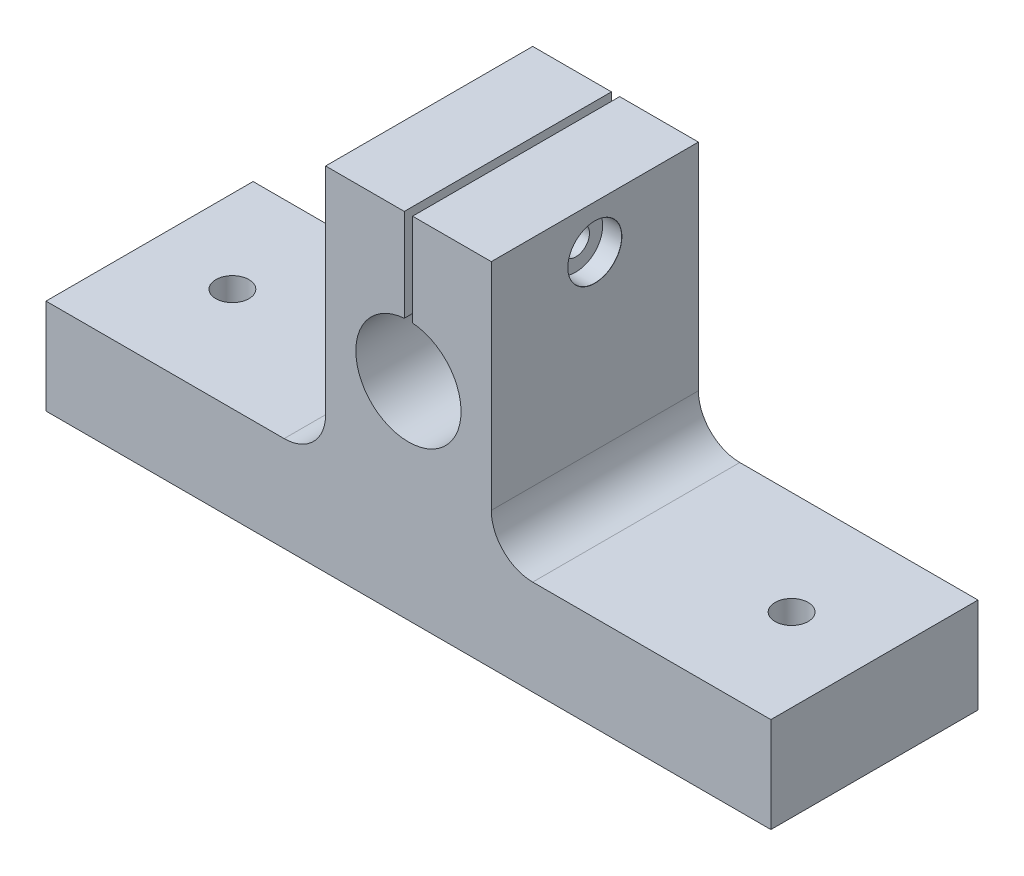
ISO-10303-21;
HEADER;
FILE_DESCRIPTION(('STEP AP214'),'2;1');
FILE_NAME('part.step','',(''),(''),'','','');
FILE_SCHEMA(('AUTOMOTIVE_DESIGN { 1 0 10303 214 1 1 1 1 }'));
ENDSEC;
DATA;
#1=APPLICATION_CONTEXT('core data for automotive mechanical design processes');
#2=APPLICATION_PROTOCOL_DEFINITION('international standard','automotive_design',2000,#1);
#3=PRODUCT_CONTEXT('',#1,'mechanical');
#4=PRODUCT('Part','Part','',(#3));
#5=PRODUCT_RELATED_PRODUCT_CATEGORY('part','',(#4));
#6=PRODUCT_DEFINITION_FORMATION('','',#4);
#7=PRODUCT_DEFINITION_CONTEXT('part definition',#1,'design');
#8=PRODUCT_DEFINITION('design','',#6,#7);
#9=PRODUCT_DEFINITION_SHAPE('','',#8);
#10=(LENGTH_UNIT() NAMED_UNIT(*) SI_UNIT(.MILLI.,.METRE.));
#11=(NAMED_UNIT(*) PLANE_ANGLE_UNIT() SI_UNIT($,.RADIAN.));
#12=(NAMED_UNIT(*) SI_UNIT($,.STERADIAN.) SOLID_ANGLE_UNIT());
#13=UNCERTAINTY_MEASURE_WITH_UNIT(LENGTH_MEASURE(1.E-05),#10,'distance_accuracy_value','');
#14=(GEOMETRIC_REPRESENTATION_CONTEXT(3) GLOBAL_UNCERTAINTY_ASSIGNED_CONTEXT((#13)) GLOBAL_UNIT_ASSIGNED_CONTEXT((#10,
#11,#12)) REPRESENTATION_CONTEXT('',''));
#15=CARTESIAN_POINT('',(0.,0.,0.));
#16=DIRECTION('',(0.,0.,1.));
#17=DIRECTION('',(1.,0.,0.));
#18=AXIS2_PLACEMENT_3D('',#15,#16,#17);
#19=CARTESIAN_POINT('',(-20.,85.,50.));
#20=DIRECTION('',(0.,-1.,0.));
#21=DIRECTION('',(0.,0.,-1.));
#22=AXIS2_PLACEMENT_3D('',#19,#20,#21);
#23=PLANE('',#22);
#24=DIRECTION('',(0.,0.,1.));
#25=VECTOR('',#24,1.);
#26=CARTESIAN_POINT('',(-1.,85.,0.));
#27=LINE('',#26,#25);
#28=CARTESIAN_POINT('',(-1.,85.,0.));
#29=VERTEX_POINT('',#28);
#30=CARTESIAN_POINT('',(-1.,85.,50.));
#31=VERTEX_POINT('',#30);
#32=EDGE_CURVE('E183',#29,#31,#27,.T.);
#33=ORIENTED_EDGE('',*,*,#32,.F.);
#34=DIRECTION('',(-1.,0.,0.));
#35=VECTOR('',#34,1.);
#36=CARTESIAN_POINT('',(-20.,85.,0.));
#37=LINE('',#36,#35);
#38=CARTESIAN_POINT('',(-20.,85.,0.));
#39=VERTEX_POINT('',#38);
#40=EDGE_CURVE('E166',#29,#39,#37,.T.);
#41=ORIENTED_EDGE('',*,*,#40,.T.);
#42=DIRECTION('',(0.,0.,-1.));
#43=VECTOR('',#42,1.);
#44=CARTESIAN_POINT('',(-20.,85.,50.));
#45=LINE('',#44,#43);
#46=CARTESIAN_POINT('',(-20.,85.,50.));
#47=VERTEX_POINT('',#46);
#48=EDGE_CURVE('E267',#47,#39,#45,.T.);
#49=ORIENTED_EDGE('',*,*,#48,.F.);
#50=DIRECTION('',(-1.,0.,0.));
#51=VECTOR('',#50,1.);
#52=CARTESIAN_POINT('',(-20.,85.,50.));
#53=LINE('',#52,#51);
#54=EDGE_CURVE('E226',#31,#47,#53,.T.);
#55=ORIENTED_EDGE('',*,*,#54,.F.);
#56=EDGE_LOOP('',(#33,#41,#49,#55));
#57=FACE_BOUND('',#56,.T.);
#58=ADVANCED_FACE('F39',(#57),#23,.F.);
#59=CARTESIAN_POINT('',(0.,0.,50.));
#60=DIRECTION('',(0.,0.,-1.));
#61=DIRECTION('',(-1.,0.,0.));
#62=AXIS2_PLACEMENT_3D('',#59,#60,#61);
#63=PLANE('',#62);
#64=DIRECTION('',(0.,1.,0.));
#65=VECTOR('',#64,1.);
#66=CARTESIAN_POINT('',(-1.,0.,50.));
#67=LINE('',#66,#65);
#68=CARTESIAN_POINT('',(-1.,62.6605687076055,50.));
#69=VERTEX_POINT('',#68);
#70=EDGE_CURVE('E148',#69,#31,#67,.T.);
#71=ORIENTED_EDGE('',*,*,#70,.T.);
#72=ORIENTED_EDGE('',*,*,#54,.T.);
#73=DIRECTION('',(0.,-1.,0.));
#74=VECTOR('',#73,1.);
#75=CARTESIAN_POINT('',(-20.,23.,50.));
#76=LINE('',#75,#74);
#77=CARTESIAN_POINT('',(-20.,33.,50.));
#78=VERTEX_POINT('',#77);
#79=EDGE_CURVE('E231',#47,#78,#76,.T.);
#80=ORIENTED_EDGE('',*,*,#79,.T.);
#81=CARTESIAN_POINT('',(-30.,33.,50.));
#82=DIRECTION('',(0.,0.,-1.));
#83=DIRECTION('',(-1.,0.,0.));
#84=AXIS2_PLACEMENT_3D('',#81,#82,#83);
#85=CIRCLE('',#84,10.);
#86=CARTESIAN_POINT('',(-30.,23.,50.));
#87=VERTEX_POINT('',#86);
#88=EDGE_CURVE('E303',#78,#87,#85,.T.);
#89=ORIENTED_EDGE('',*,*,#88,.T.);
#90=DIRECTION('',(-1.,0.,0.));
#91=VECTOR('',#90,1.);
#92=CARTESIAN_POINT('',(-87.5,23.,50.));
#93=LINE('',#92,#91);
#94=CARTESIAN_POINT('',(-87.5,23.,50.));
#95=VERTEX_POINT('',#94);
#96=EDGE_CURVE('E235',#87,#95,#93,.T.);
#97=ORIENTED_EDGE('',*,*,#96,.T.);
#98=DIRECTION('',(0.,-1.,0.));
#99=VECTOR('',#98,1.);
#100=CARTESIAN_POINT('',(-87.5,0.,50.));
#101=LINE('',#100,#99);
#102=CARTESIAN_POINT('',(-87.5,0.,50.));
#103=VERTEX_POINT('',#102);
#104=EDGE_CURVE('E209',#95,#103,#101,.T.);
#105=ORIENTED_EDGE('',*,*,#104,.T.);
#106=DIRECTION('',(1.,0.,0.));
#107=VECTOR('',#106,1.);
#108=CARTESIAN_POINT('',(87.5,0.,50.));
#109=LINE('',#108,#107);
#110=CARTESIAN_POINT('',(87.5,0.,50.));
#111=VERTEX_POINT('',#110);
#112=EDGE_CURVE('E213',#103,#111,#109,.T.);
#113=ORIENTED_EDGE('',*,*,#112,.T.);
#114=DIRECTION('',(0.,1.,0.));
#115=VECTOR('',#114,1.);
#116=CARTESIAN_POINT('',(87.5,0.,50.));
#117=LINE('',#116,#115);
#118=CARTESIAN_POINT('',(87.5,23.,50.));
#119=VERTEX_POINT('',#118);
#120=EDGE_CURVE('E217',#111,#119,#117,.T.);
#121=ORIENTED_EDGE('',*,*,#120,.T.);
#122=DIRECTION('',(-1.,0.,0.));
#123=VECTOR('',#122,1.);
#124=CARTESIAN_POINT('',(87.5,23.,50.));
#125=LINE('',#124,#123);
#126=CARTESIAN_POINT('',(30.,23.,50.));
#127=VERTEX_POINT('',#126);
#128=EDGE_CURVE('E220',#119,#127,#125,.T.);
#129=ORIENTED_EDGE('',*,*,#128,.T.);
#130=CARTESIAN_POINT('',(30.,33.,50.));
#131=DIRECTION('',(0.,0.,-1.));
#132=DIRECTION('',(-1.,0.,0.));
#133=AXIS2_PLACEMENT_3D('',#130,#131,#132);
#134=CIRCLE('',#133,10.);
#135=CARTESIAN_POINT('',(20.,33.,50.));
#136=VERTEX_POINT('',#135);
#137=EDGE_CURVE('E11',#127,#136,#134,.T.);
#138=ORIENTED_EDGE('',*,*,#137,.T.);
#139=DIRECTION('',(0.,1.,0.));
#140=VECTOR('',#139,1.);
#141=CARTESIAN_POINT('',(20.,23.,50.));
#142=LINE('',#141,#140);
#143=CARTESIAN_POINT('',(20.,85.,50.));
#144=VERTEX_POINT('',#143);
#145=EDGE_CURVE('E223',#136,#144,#142,.T.);
#146=ORIENTED_EDGE('',*,*,#145,.T.);
#147=CARTESIAN_POINT('',(1.,85.,50.));
#148=VERTEX_POINT('',#147);
#149=EDGE_CURVE('E227',#144,#148,#53,.T.);
#150=ORIENTED_EDGE('',*,*,#149,.T.);
#151=DIRECTION('',(0.,1.,0.));
#152=VECTOR('',#151,1.);
#153=CARTESIAN_POINT('',(1.,0.,50.));
#154=LINE('',#153,#152);
#155=CARTESIAN_POINT('',(1.,62.6605687076055,50.));
#156=VERTEX_POINT('',#155);
#157=EDGE_CURVE('E168',#156,#148,#154,.T.);
#158=ORIENTED_EDGE('',*,*,#157,.F.);
#159=CARTESIAN_POINT('',(0.,50.,50.));
#160=DIRECTION('',(0.,0.,1.));
#161=DIRECTION('',(1.,0.,0.));
#162=AXIS2_PLACEMENT_3D('',#159,#160,#161);
#163=CIRCLE('',#162,12.7);
#164=EDGE_CURVE('E171',#69,#156,#163,.T.);
#165=ORIENTED_EDGE('',*,*,#164,.F.);
#166=EDGE_LOOP('',(#71,#72,#80,#89,#97,#105,#113,#121,#129,#138,#146,#150,#158,#165));
#167=FACE_BOUND('',#166,.T.);
#168=ADVANCED_FACE('F328',(#167),#63,.F.);
#169=CARTESIAN_POINT('',(0.,0.,0.));
#170=DIRECTION('',(0.,0.,-1.));
#171=DIRECTION('',(-1.,0.,0.));
#172=AXIS2_PLACEMENT_3D('',#169,#170,#171);
#173=PLANE('',#172);
#174=ORIENTED_EDGE('',*,*,#40,.F.);
#175=DIRECTION('',(0.,1.,0.));
#176=VECTOR('',#175,1.);
#177=CARTESIAN_POINT('',(-1.,0.,0.));
#178=LINE('',#177,#176);
#179=CARTESIAN_POINT('',(-1.,62.6605687076055,0.));
#180=VERTEX_POINT('',#179);
#181=EDGE_CURVE('E145',#180,#29,#178,.T.);
#182=ORIENTED_EDGE('',*,*,#181,.F.);
#183=CARTESIAN_POINT('',(0.,50.,0.));
#184=DIRECTION('',(0.,0.,1.));
#185=DIRECTION('',(1.,0.,0.));
#186=AXIS2_PLACEMENT_3D('',#183,#184,#185);
#187=CIRCLE('',#186,12.7);
#188=CARTESIAN_POINT('',(1.,62.6605687076055,0.));
#189=VERTEX_POINT('',#188);
#190=EDGE_CURVE('E158',#180,#189,#187,.T.);
#191=ORIENTED_EDGE('',*,*,#190,.T.);
#192=DIRECTION('',(0.,1.,0.));
#193=VECTOR('',#192,1.);
#194=CARTESIAN_POINT('',(1.,0.,0.));
#195=LINE('',#194,#193);
#196=CARTESIAN_POINT('',(1.,85.,0.));
#197=VERTEX_POINT('',#196);
#198=EDGE_CURVE('E154',#189,#197,#195,.T.);
#199=ORIENTED_EDGE('',*,*,#198,.T.);
#200=CARTESIAN_POINT('',(20.,85.,0.));
#201=VERTEX_POINT('',#200);
#202=EDGE_CURVE('E254',#201,#197,#37,.T.);
#203=ORIENTED_EDGE('',*,*,#202,.F.);
#204=DIRECTION('',(0.,1.,0.));
#205=VECTOR('',#204,1.);
#206=CARTESIAN_POINT('',(20.,23.,0.));
#207=LINE('',#206,#205);
#208=CARTESIAN_POINT('',(20.,33.,0.));
#209=VERTEX_POINT('',#208);
#210=EDGE_CURVE('E251',#209,#201,#207,.T.);
#211=ORIENTED_EDGE('',*,*,#210,.F.);
#212=CARTESIAN_POINT('',(30.,33.,0.));
#213=DIRECTION('',(0.,0.,-1.));
#214=DIRECTION('',(-1.,0.,0.));
#215=AXIS2_PLACEMENT_3D('',#212,#213,#214);
#216=CIRCLE('',#215,10.);
#217=CARTESIAN_POINT('',(30.,23.,0.));
#218=VERTEX_POINT('',#217);
#219=EDGE_CURVE('E49',#209,#218,#216,.F.);
#220=ORIENTED_EDGE('',*,*,#219,.T.);
#221=DIRECTION('',(-1.,0.,0.));
#222=VECTOR('',#221,1.);
#223=CARTESIAN_POINT('',(87.5,23.,0.));
#224=LINE('',#223,#222);
#225=CARTESIAN_POINT('',(87.5,23.,0.));
#226=VERTEX_POINT('',#225);
#227=EDGE_CURVE('E248',#226,#218,#224,.T.);
#228=ORIENTED_EDGE('',*,*,#227,.F.);
#229=DIRECTION('',(0.,1.,0.));
#230=VECTOR('',#229,1.);
#231=CARTESIAN_POINT('',(87.5,0.,0.));
#232=LINE('',#231,#230);
#233=CARTESIAN_POINT('',(87.5,0.,0.));
#234=VERTEX_POINT('',#233);
#235=EDGE_CURVE('E245',#234,#226,#232,.T.);
#236=ORIENTED_EDGE('',*,*,#235,.F.);
#237=DIRECTION('',(1.,0.,0.));
#238=VECTOR('',#237,1.);
#239=CARTESIAN_POINT('',(87.5,0.,0.));
#240=LINE('',#239,#238);
#241=CARTESIAN_POINT('',(-87.5,0.,0.));
#242=VERTEX_POINT('',#241);
#243=EDGE_CURVE('E242',#242,#234,#240,.T.);
#244=ORIENTED_EDGE('',*,*,#243,.F.);
#245=DIRECTION('',(0.,-1.,0.));
#246=VECTOR('',#245,1.);
#247=CARTESIAN_POINT('',(-87.5,0.,0.));
#248=LINE('',#247,#246);
#249=CARTESIAN_POINT('',(-87.5,23.,0.));
#250=VERTEX_POINT('',#249);
#251=EDGE_CURVE('E197',#250,#242,#248,.T.);
#252=ORIENTED_EDGE('',*,*,#251,.F.);
#253=DIRECTION('',(-1.,0.,0.));
#254=VECTOR('',#253,1.);
#255=CARTESIAN_POINT('',(-87.5,23.,0.));
#256=LINE('',#255,#254);
#257=CARTESIAN_POINT('',(-30.,23.,0.));
#258=VERTEX_POINT('',#257);
#259=EDGE_CURVE('E214',#258,#250,#256,.T.);
#260=ORIENTED_EDGE('',*,*,#259,.F.);
#261=CARTESIAN_POINT('',(-30.,33.,0.));
#262=DIRECTION('',(0.,0.,-1.));
#263=DIRECTION('',(-1.,0.,0.));
#264=AXIS2_PLACEMENT_3D('',#261,#262,#263);
#265=CIRCLE('',#264,10.);
#266=CARTESIAN_POINT('',(-20.,33.,0.));
#267=VERTEX_POINT('',#266);
#268=EDGE_CURVE('E300',#258,#267,#265,.F.);
#269=ORIENTED_EDGE('',*,*,#268,.T.);
#270=DIRECTION('',(0.,-1.,0.));
#271=VECTOR('',#270,1.);
#272=CARTESIAN_POINT('',(-20.,23.,0.));
#273=LINE('',#272,#271);
#274=EDGE_CURVE('E258',#39,#267,#273,.T.);
#275=ORIENTED_EDGE('',*,*,#274,.F.);
#276=EDGE_LOOP('',(#174,#182,#191,#199,#203,#211,#220,#228,#236,#244,#252,#260,#269,#275));
#277=FACE_BOUND('',#276,.T.);
#278=ADVANCED_FACE('F164',(#277),#173,.T.);
#279=CARTESIAN_POINT('',(-87.5,0.,50.));
#280=DIRECTION('',(1.,0.,0.));
#281=DIRECTION('',(0.,0.,-1.));
#282=AXIS2_PLACEMENT_3D('',#279,#280,#281);
#283=PLANE('',#282);
#284=ORIENTED_EDGE('',*,*,#251,.T.);
#285=DIRECTION('',(0.,0.,-1.));
#286=VECTOR('',#285,1.);
#287=CARTESIAN_POINT('',(-87.5,0.,50.));
#288=LINE('',#287,#286);
#289=EDGE_CURVE('E283',#103,#242,#288,.T.);
#290=ORIENTED_EDGE('',*,*,#289,.F.);
#291=ORIENTED_EDGE('',*,*,#104,.F.);
#292=DIRECTION('',(0.,0.,-1.));
#293=VECTOR('',#292,1.);
#294=CARTESIAN_POINT('',(-87.5,23.,50.));
#295=LINE('',#294,#293);
#296=EDGE_CURVE('E238',#95,#250,#295,.T.);
#297=ORIENTED_EDGE('',*,*,#296,.T.);
#298=EDGE_LOOP('',(#284,#290,#291,#297));
#299=FACE_BOUND('',#298,.T.);
#300=ADVANCED_FACE('F354',(#299),#283,.F.);
#301=CARTESIAN_POINT('',(87.5,0.,50.));
#302=DIRECTION('',(0.,1.,0.));
#303=DIRECTION('',(0.,0.,1.));
#304=AXIS2_PLACEMENT_3D('',#301,#302,#303);
#305=PLANE('',#304);
#306=CARTESIAN_POINT('',(-67.5,0.,25.));
#307=DIRECTION('',(0.,1.,0.));
#308=DIRECTION('',(0.,0.,1.));
#309=AXIS2_PLACEMENT_3D('',#306,#307,#308);
#310=CIRCLE('',#309,4.00000000000001);
#311=CARTESIAN_POINT('',(-67.5,0.,29.));
#312=VERTEX_POINT('',#311);
#313=EDGE_CURVE('E193',#312,#312,#310,.T.);
#314=ORIENTED_EDGE('',*,*,#313,.T.);
#315=EDGE_LOOP('',(#314));
#316=FACE_BOUND('',#315,.T.);
#317=CARTESIAN_POINT('',(67.5,0.,25.));
#318=DIRECTION('',(0.,1.,0.));
#319=DIRECTION('',(0.,0.,-1.));
#320=AXIS2_PLACEMENT_3D('',#317,#318,#319);
#321=CIRCLE('',#320,4.00000000000001);
#322=CARTESIAN_POINT('',(67.5,0.,21.));
#323=VERTEX_POINT('',#322);
#324=EDGE_CURVE('E202',#323,#323,#321,.T.);
#325=ORIENTED_EDGE('',*,*,#324,.T.);
#326=EDGE_LOOP('',(#325));
#327=FACE_BOUND('',#326,.T.);
#328=ORIENTED_EDGE('',*,*,#243,.T.);
#329=DIRECTION('',(0.,0.,-1.));
#330=VECTOR('',#329,1.);
#331=CARTESIAN_POINT('',(87.5,0.,50.));
#332=LINE('',#331,#330);
#333=EDGE_CURVE('E279',#111,#234,#332,.T.);
#334=ORIENTED_EDGE('',*,*,#333,.F.);
#335=ORIENTED_EDGE('',*,*,#112,.F.);
#336=ORIENTED_EDGE('',*,*,#289,.T.);
#337=EDGE_LOOP('',(#328,#334,#335,#336));
#338=FACE_BOUND('',#337,.T.);
#339=ADVANCED_FACE('F352',(#316,#327,#338),#305,.F.);
#340=CARTESIAN_POINT('',(87.5,0.,50.));
#341=DIRECTION('',(-1.,0.,0.));
#342=DIRECTION('',(0.,0.,1.));
#343=AXIS2_PLACEMENT_3D('',#340,#341,#342);
#344=PLANE('',#343);
#345=ORIENTED_EDGE('',*,*,#235,.T.);
#346=DIRECTION('',(0.,0.,-1.));
#347=VECTOR('',#346,1.);
#348=CARTESIAN_POINT('',(87.5,23.,50.));
#349=LINE('',#348,#347);
#350=EDGE_CURVE('E275',#119,#226,#349,.T.);
#351=ORIENTED_EDGE('',*,*,#350,.F.);
#352=ORIENTED_EDGE('',*,*,#120,.F.);
#353=ORIENTED_EDGE('',*,*,#333,.T.);
#354=EDGE_LOOP('',(#345,#351,#352,#353));
#355=FACE_BOUND('',#354,.T.);
#356=ADVANCED_FACE('F349',(#355),#344,.F.);
#357=CARTESIAN_POINT('',(87.5,23.,50.));
#358=DIRECTION('',(0.,-1.,0.));
#359=DIRECTION('',(0.,0.,-1.));
#360=AXIS2_PLACEMENT_3D('',#357,#358,#359);
#361=PLANE('',#360);
#362=CARTESIAN_POINT('',(67.5,23.,25.));
#363=DIRECTION('',(0.,1.,0.));
#364=DIRECTION('',(0.,0.,-1.));
#365=AXIS2_PLACEMENT_3D('',#362,#363,#364);
#366=CIRCLE('',#365,4.00000000000001);
#367=CARTESIAN_POINT('',(67.5,23.,21.));
#368=VERTEX_POINT('',#367);
#369=EDGE_CURVE('E186',#368,#368,#366,.T.);
#370=ORIENTED_EDGE('',*,*,#369,.F.);
#371=EDGE_LOOP('',(#370));
#372=FACE_BOUND('',#371,.T.);
#373=ORIENTED_EDGE('',*,*,#227,.T.);
#374=DIRECTION('',(0.,0.,-1.));
#375=VECTOR('',#374,1.);
#376=CARTESIAN_POINT('',(30.,23.,50.));
#377=LINE('',#376,#375);
#378=EDGE_CURVE('E56',#218,#127,#377,.F.);
#379=ORIENTED_EDGE('',*,*,#378,.T.);
#380=ORIENTED_EDGE('',*,*,#128,.F.);
#381=ORIENTED_EDGE('',*,*,#350,.T.);
#382=EDGE_LOOP('',(#373,#379,#380,#381));
#383=FACE_BOUND('',#382,.T.);
#384=ADVANCED_FACE('F346',(#372,#383),#361,.F.);
#385=CARTESIAN_POINT('',(20.,23.,50.));
#386=DIRECTION('',(-1.,0.,0.));
#387=DIRECTION('',(0.,-1.,0.));
#388=AXIS2_PLACEMENT_3D('',#385,#386,#387);
#389=PLANE('',#388);
#390=CARTESIAN_POINT('',(20.,74.5,25.));
#391=DIRECTION('',(1.,0.,0.));
#392=DIRECTION('',(0.,0.,-1.));
#393=AXIS2_PLACEMENT_3D('',#390,#391,#392);
#394=CIRCLE('',#393,6.525);
#395=CARTESIAN_POINT('',(20.,74.5,18.475));
#396=VERTEX_POINT('',#395);
#397=EDGE_CURVE('E587',#396,#396,#394,.T.);
#398=ORIENTED_EDGE('',*,*,#397,.F.);
#399=EDGE_LOOP('',(#398));
#400=FACE_BOUND('',#399,.T.);
#401=ORIENTED_EDGE('',*,*,#145,.F.);
#402=DIRECTION('',(0.,0.,-1.));
#403=VECTOR('',#402,1.);
#404=CARTESIAN_POINT('',(20.,33.,0.));
#405=LINE('',#404,#403);
#406=EDGE_CURVE('E294',#136,#209,#405,.T.);
#407=ORIENTED_EDGE('',*,*,#406,.T.);
#408=ORIENTED_EDGE('',*,*,#210,.T.);
#409=DIRECTION('',(0.,0.,-1.));
#410=VECTOR('',#409,1.);
#411=CARTESIAN_POINT('',(20.,85.,50.));
#412=LINE('',#411,#410);
#413=EDGE_CURVE('E271',#144,#201,#412,.T.);
#414=ORIENTED_EDGE('',*,*,#413,.F.);
#415=EDGE_LOOP('',(#401,#407,#408,#414));
#416=FACE_BOUND('',#415,.T.);
#417=ADVANCED_FACE('F340',(#400,#416),#389,.F.);
#418=ORIENTED_EDGE('',*,*,#202,.T.);
#419=DIRECTION('',(0.,0.,1.));
#420=VECTOR('',#419,1.);
#421=CARTESIAN_POINT('',(1.,85.,0.));
#422=LINE('',#421,#420);
#423=EDGE_CURVE('E187',#197,#148,#422,.T.);
#424=ORIENTED_EDGE('',*,*,#423,.T.);
#425=ORIENTED_EDGE('',*,*,#149,.F.);
#426=ORIENTED_EDGE('',*,*,#413,.T.);
#427=EDGE_LOOP('',(#418,#424,#425,#426));
#428=FACE_BOUND('',#427,.T.);
#429=ADVANCED_FACE('F335',(#428),#23,.F.);
#430=CARTESIAN_POINT('',(-20.,23.,50.));
#431=DIRECTION('',(1.,0.,0.));
#432=DIRECTION('',(0.,1.,0.));
#433=AXIS2_PLACEMENT_3D('',#430,#431,#432);
#434=PLANE('',#433);
#435=CARTESIAN_POINT('',(-20.,74.5,25.));
#436=DIRECTION('',(1.,0.,0.));
#437=DIRECTION('',(0.,1.,0.));
#438=AXIS2_PLACEMENT_3D('',#435,#436,#437);
#439=CIRCLE('',#438,3.29999999999998);
#440=CARTESIAN_POINT('',(-20.,77.8,25.));
#441=VERTEX_POINT('',#440);
#442=EDGE_CURVE('E569',#441,#441,#439,.T.);
#443=ORIENTED_EDGE('',*,*,#442,.T.);
#444=EDGE_LOOP('',(#443));
#445=FACE_BOUND('',#444,.T.);
#446=ORIENTED_EDGE('',*,*,#274,.T.);
#447=DIRECTION('',(0.,0.,-1.));
#448=VECTOR('',#447,1.);
#449=CARTESIAN_POINT('',(-20.,33.,50.));
#450=LINE('',#449,#448);
#451=EDGE_CURVE('E291',#267,#78,#450,.F.);
#452=ORIENTED_EDGE('',*,*,#451,.T.);
#453=ORIENTED_EDGE('',*,*,#79,.F.);
#454=ORIENTED_EDGE('',*,*,#48,.T.);
#455=EDGE_LOOP('',(#446,#452,#453,#454));
#456=FACE_BOUND('',#455,.T.);
#457=ADVANCED_FACE('F314',(#445,#456),#434,.F.);
#458=CARTESIAN_POINT('',(-87.5,23.,50.));
#459=DIRECTION('',(0.,-1.,0.));
#460=DIRECTION('',(0.,0.,-1.));
#461=AXIS2_PLACEMENT_3D('',#458,#459,#460);
#462=PLANE('',#461);
#463=CARTESIAN_POINT('',(-67.5,23.,25.));
#464=DIRECTION('',(0.,1.,0.));
#465=DIRECTION('',(0.,0.,1.));
#466=AXIS2_PLACEMENT_3D('',#463,#464,#465);
#467=CIRCLE('',#466,4.00000000000001);
#468=CARTESIAN_POINT('',(-67.5,23.,29.));
#469=VERTEX_POINT('',#468);
#470=EDGE_CURVE('E198',#469,#469,#467,.T.);
#471=ORIENTED_EDGE('',*,*,#470,.F.);
#472=EDGE_LOOP('',(#471));
#473=FACE_BOUND('',#472,.T.);
#474=ORIENTED_EDGE('',*,*,#96,.F.);
#475=DIRECTION('',(0.,0.,-1.));
#476=VECTOR('',#475,1.);
#477=CARTESIAN_POINT('',(-30.,23.,0.));
#478=LINE('',#477,#476);
#479=EDGE_CURVE('E287',#87,#258,#478,.T.);
#480=ORIENTED_EDGE('',*,*,#479,.T.);
#481=ORIENTED_EDGE('',*,*,#259,.T.);
#482=ORIENTED_EDGE('',*,*,#296,.F.);
#483=EDGE_LOOP('',(#474,#480,#481,#482));
#484=FACE_BOUND('',#483,.T.);
#485=ADVANCED_FACE('F324',(#473,#484),#462,.F.);
#486=CARTESIAN_POINT('',(-67.5,0.,25.));
#487=DIRECTION('',(0.,1.,0.));
#488=DIRECTION('',(0.,0.,1.));
#489=AXIS2_PLACEMENT_3D('',#486,#487,#488);
#490=CYLINDRICAL_SURFACE('',#489,4.00000000000001);
#491=ORIENTED_EDGE('',*,*,#313,.F.);
#492=EDGE_LOOP('',(#491));
#493=FACE_BOUND('',#492,.T.);
#494=ORIENTED_EDGE('',*,*,#470,.T.);
#495=EDGE_LOOP('',(#494));
#496=FACE_BOUND('',#495,.T.);
#497=ADVANCED_FACE('F409',(#493,#496),#490,.F.);
#498=CARTESIAN_POINT('',(67.5,0.,25.));
#499=DIRECTION('',(0.,1.,0.));
#500=DIRECTION('',(0.,0.,1.));
#501=AXIS2_PLACEMENT_3D('',#498,#499,#500);
#502=CYLINDRICAL_SURFACE('',#501,4.00000000000001);
#503=ORIENTED_EDGE('',*,*,#324,.F.);
#504=EDGE_LOOP('',(#503));
#505=FACE_BOUND('',#504,.T.);
#506=ORIENTED_EDGE('',*,*,#369,.T.);
#507=EDGE_LOOP('',(#506));
#508=FACE_BOUND('',#507,.T.);
#509=ADVANCED_FACE('F450',(#505,#508),#502,.F.);
#510=CARTESIAN_POINT('',(-1.,0.,0.));
#511=DIRECTION('',(1.,0.,0.));
#512=DIRECTION('',(0.,0.,-1.));
#513=AXIS2_PLACEMENT_3D('',#510,#511,#512);
#514=PLANE('',#513);
#515=CARTESIAN_POINT('',(-1.,74.5,25.));
#516=DIRECTION('',(1.,0.,0.));
#517=DIRECTION('',(0.,0.,-1.));
#518=AXIS2_PLACEMENT_3D('',#515,#516,#517);
#519=CIRCLE('',#518,3.29999999999998);
#520=CARTESIAN_POINT('',(-1.,74.5,21.7));
#521=VERTEX_POINT('',#520);
#522=EDGE_CURVE('E174',#521,#521,#519,.T.);
#523=ORIENTED_EDGE('',*,*,#522,.F.);
#524=EDGE_LOOP('',(#523));
#525=FACE_BOUND('',#524,.T.);
#526=ORIENTED_EDGE('',*,*,#70,.F.);
#527=DIRECTION('',(0.,0.,1.));
#528=VECTOR('',#527,1.);
#529=CARTESIAN_POINT('',(-1.,62.6605687076055,0.));
#530=LINE('',#529,#528);
#531=EDGE_CURVE('E141',#180,#69,#530,.T.);
#532=ORIENTED_EDGE('',*,*,#531,.F.);
#533=ORIENTED_EDGE('',*,*,#181,.T.);
#534=ORIENTED_EDGE('',*,*,#32,.T.);
#535=EDGE_LOOP('',(#526,#532,#533,#534));
#536=FACE_BOUND('',#535,.T.);
#537=ADVANCED_FACE('F143',(#525,#536),#514,.T.);
#538=CARTESIAN_POINT('',(1.,0.,0.));
#539=DIRECTION('',(1.,0.,0.));
#540=DIRECTION('',(0.,1.,0.));
#541=AXIS2_PLACEMENT_3D('',#538,#539,#540);
#542=PLANE('',#541);
#543=CARTESIAN_POINT('',(1.,74.5,25.));
#544=DIRECTION('',(1.,0.,0.));
#545=DIRECTION('',(0.,1.,0.));
#546=AXIS2_PLACEMENT_3D('',#543,#544,#545);
#547=CIRCLE('',#546,3.29999999999998);
#548=CARTESIAN_POINT('',(1.,77.8,25.));
#549=VERTEX_POINT('',#548);
#550=EDGE_CURVE('E43',#549,#549,#547,.T.);
#551=ORIENTED_EDGE('',*,*,#550,.T.);
#552=EDGE_LOOP('',(#551));
#553=FACE_BOUND('',#552,.T.);
#554=ORIENTED_EDGE('',*,*,#157,.T.);
#555=ORIENTED_EDGE('',*,*,#423,.F.);
#556=ORIENTED_EDGE('',*,*,#198,.F.);
#557=DIRECTION('',(0.,0.,1.));
#558=VECTOR('',#557,1.);
#559=CARTESIAN_POINT('',(1.,62.6605687076055,0.));
#560=LINE('',#559,#558);
#561=EDGE_CURVE('E153',#189,#156,#560,.T.);
#562=ORIENTED_EDGE('',*,*,#561,.T.);
#563=EDGE_LOOP('',(#554,#555,#556,#562));
#564=FACE_BOUND('',#563,.T.);
#565=ADVANCED_FACE('F333',(#553,#564),#542,.F.);
#566=CARTESIAN_POINT('',(0.,50.,0.));
#567=DIRECTION('',(0.,0.,1.));
#568=DIRECTION('',(1.,0.,0.));
#569=AXIS2_PLACEMENT_3D('',#566,#567,#568);
#570=CYLINDRICAL_SURFACE('',#569,12.7);
#571=ORIENTED_EDGE('',*,*,#164,.T.);
#572=ORIENTED_EDGE('',*,*,#561,.F.);
#573=ORIENTED_EDGE('',*,*,#190,.F.);
#574=ORIENTED_EDGE('',*,*,#531,.T.);
#575=EDGE_LOOP('',(#571,#572,#573,#574));
#576=FACE_BOUND('',#575,.T.);
#577=ADVANCED_FACE('F159',(#576),#570,.F.);
#578=CARTESIAN_POINT('',(-30.,33.,50.));
#579=DIRECTION('',(0.,0.,1.));
#580=DIRECTION('',(1.,0.,0.));
#581=AXIS2_PLACEMENT_3D('',#578,#579,#580);
#582=CYLINDRICAL_SURFACE('',#581,10.);
#583=ORIENTED_EDGE('',*,*,#88,.F.);
#584=ORIENTED_EDGE('',*,*,#451,.F.);
#585=ORIENTED_EDGE('',*,*,#268,.F.);
#586=ORIENTED_EDGE('',*,*,#479,.F.);
#587=EDGE_LOOP('',(#583,#584,#585,#586));
#588=FACE_BOUND('',#587,.T.);
#589=ADVANCED_FACE('F321',(#588),#582,.F.);
#590=CARTESIAN_POINT('',(30.,33.,50.));
#591=DIRECTION('',(0.,0.,1.));
#592=DIRECTION('',(1.,0.,0.));
#593=AXIS2_PLACEMENT_3D('',#590,#591,#592);
#594=CYLINDRICAL_SURFACE('',#593,10.);
#595=ORIENTED_EDGE('',*,*,#137,.F.);
#596=ORIENTED_EDGE('',*,*,#378,.F.);
#597=ORIENTED_EDGE('',*,*,#219,.F.);
#598=ORIENTED_EDGE('',*,*,#406,.F.);
#599=EDGE_LOOP('',(#595,#596,#597,#598));
#600=FACE_BOUND('',#599,.T.);
#601=ADVANCED_FACE('F41',(#600),#594,.F.);
#602=CARTESIAN_POINT('',(20.,74.5,25.));
#603=DIRECTION('',(1.,0.,0.));
#604=DIRECTION('',(0.,0.,-1.));
#605=AXIS2_PLACEMENT_3D('',#602,#603,#604);
#606=CONICAL_SURFACE('',#605,6.525,0.785398163397379);
#607=CARTESIAN_POINT('',(19.975,74.5,25.));
#608=DIRECTION('',(1.,0.,0.));
#609=DIRECTION('',(0.,0.,-1.));
#610=AXIS2_PLACEMENT_3D('',#607,#608,#609);
#611=CIRCLE('',#610,6.50000000000001);
#612=CARTESIAN_POINT('',(19.975,74.5,18.5));
#613=VERTEX_POINT('',#612);
#614=EDGE_CURVE('E583',#613,#613,#611,.T.);
#615=ORIENTED_EDGE('',*,*,#614,.F.);
#616=EDGE_LOOP('',(#615));
#617=FACE_BOUND('',#616,.T.);
#618=ORIENTED_EDGE('',*,*,#397,.T.);
#619=EDGE_LOOP('',(#618));
#620=FACE_BOUND('',#619,.T.);
#621=ADVANCED_FACE('F430',(#617,#620),#606,.F.);
#622=CARTESIAN_POINT('',(20.,74.5,25.));
#623=DIRECTION('',(1.,0.,0.));
#624=DIRECTION('',(0.,0.,-1.));
#625=AXIS2_PLACEMENT_3D('',#622,#623,#624);
#626=CYLINDRICAL_SURFACE('',#625,6.50000000000001);
#627=CARTESIAN_POINT('',(15.4,74.5,25.));
#628=DIRECTION('',(1.,0.,0.));
#629=DIRECTION('',(0.,0.,-1.));
#630=AXIS2_PLACEMENT_3D('',#627,#628,#629);
#631=CIRCLE('',#630,6.50000000000001);
#632=CARTESIAN_POINT('',(15.4,74.5,18.5));
#633=VERTEX_POINT('',#632);
#634=EDGE_CURVE('E579',#633,#633,#631,.T.);
#635=ORIENTED_EDGE('',*,*,#634,.F.);
#636=EDGE_LOOP('',(#635));
#637=FACE_BOUND('',#636,.T.);
#638=ORIENTED_EDGE('',*,*,#614,.T.);
#639=EDGE_LOOP('',(#638));
#640=FACE_BOUND('',#639,.T.);
#641=ADVANCED_FACE('F469',(#637,#640),#626,.F.);
#642=CARTESIAN_POINT('',(15.4,81.,25.));
#643=DIRECTION('',(-1.,0.,0.));
#644=DIRECTION('',(0.,0.,1.));
#645=AXIS2_PLACEMENT_3D('',#642,#643,#644);
#646=PLANE('',#645);
#647=CARTESIAN_POINT('',(15.4,74.5,25.));
#648=DIRECTION('',(1.,0.,0.));
#649=DIRECTION('',(0.,0.,-1.));
#650=AXIS2_PLACEMENT_3D('',#647,#648,#649);
#651=CIRCLE('',#650,3.3);
#652=CARTESIAN_POINT('',(15.4,74.5,21.7));
#653=VERTEX_POINT('',#652);
#654=EDGE_CURVE('E574',#653,#653,#651,.T.);
#655=ORIENTED_EDGE('',*,*,#654,.F.);
#656=EDGE_LOOP('',(#655));
#657=FACE_BOUND('',#656,.T.);
#658=ORIENTED_EDGE('',*,*,#634,.T.);
#659=EDGE_LOOP('',(#658));
#660=FACE_BOUND('',#659,.T.);
#661=ADVANCED_FACE('F479',(#657,#660),#646,.F.);
#662=CARTESIAN_POINT('',(20.,74.5,25.));
#663=DIRECTION('',(1.,0.,0.));
#664=DIRECTION('',(0.,0.,-1.));
#665=AXIS2_PLACEMENT_3D('',#662,#663,#664);
#666=CYLINDRICAL_SURFACE('',#665,3.29999999999998);
#667=ORIENTED_EDGE('',*,*,#654,.T.);
#668=EDGE_LOOP('',(#667));
#669=FACE_BOUND('',#668,.T.);
#670=ORIENTED_EDGE('',*,*,#550,.F.);
#671=EDGE_LOOP('',(#670));
#672=FACE_BOUND('',#671,.T.);
#673=ADVANCED_FACE('F489',(#669,#672),#666,.F.);
#674=ORIENTED_EDGE('',*,*,#522,.T.);
#675=EDGE_LOOP('',(#674));
#676=FACE_BOUND('',#675,.T.);
#677=ORIENTED_EDGE('',*,*,#442,.F.);
#678=EDGE_LOOP('',(#677));
#679=FACE_BOUND('',#678,.T.);
#680=ADVANCED_FACE('F499',(#676,#679),#666,.F.);
#681=CLOSED_SHELL('',(#58,#168,#278,#300,#339,#356,#384,#417,#429,#457,#485,#497,#509,#537,#565,
#577,#589,#601,#621,#641,#661,#673,#680));
#682=MANIFOLD_SOLID_BREP('B2',#681);
#683=ADVANCED_BREP_SHAPE_REPRESENTATION('',(#18,#682),#14);
#684=SHAPE_DEFINITION_REPRESENTATION(#9,#683);
ENDSEC;
END-ISO-10303-21;
